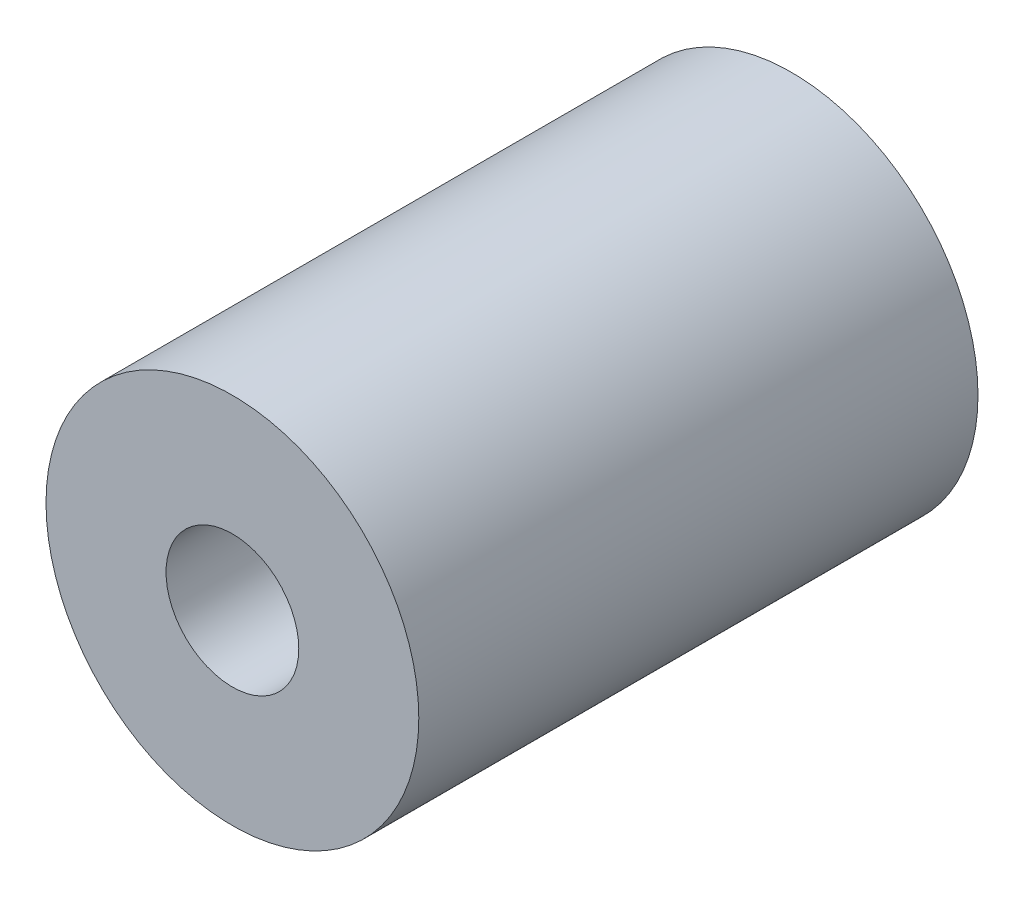
ISO-10303-21;
HEADER;
FILE_DESCRIPTION(('STEP AP214'),'2;1');
FILE_NAME('part.step','',(''),(''),'','','');
FILE_SCHEMA(('AUTOMOTIVE_DESIGN { 1 0 10303 214 1 1 1 1 }'));
ENDSEC;
DATA;
#1=APPLICATION_CONTEXT('core data for automotive mechanical design processes');
#2=APPLICATION_PROTOCOL_DEFINITION('international standard','automotive_design',2000,#1);
#3=PRODUCT_CONTEXT('',#1,'mechanical');
#4=PRODUCT('Part','Part','',(#3));
#5=PRODUCT_RELATED_PRODUCT_CATEGORY('part','',(#4));
#6=PRODUCT_DEFINITION_FORMATION('','',#4);
#7=PRODUCT_DEFINITION_CONTEXT('part definition',#1,'design');
#8=PRODUCT_DEFINITION('design','',#6,#7);
#9=PRODUCT_DEFINITION_SHAPE('','',#8);
#10=(LENGTH_UNIT() NAMED_UNIT(*) SI_UNIT(.MILLI.,.METRE.));
#11=(NAMED_UNIT(*) PLANE_ANGLE_UNIT() SI_UNIT($,.RADIAN.));
#12=(NAMED_UNIT(*) SI_UNIT($,.STERADIAN.) SOLID_ANGLE_UNIT());
#13=UNCERTAINTY_MEASURE_WITH_UNIT(LENGTH_MEASURE(1.E-05),#10,'distance_accuracy_value','');
#14=(GEOMETRIC_REPRESENTATION_CONTEXT(3) GLOBAL_UNCERTAINTY_ASSIGNED_CONTEXT((#13)) GLOBAL_UNIT_ASSIGNED_CONTEXT((#10,
#11,#12)) REPRESENTATION_CONTEXT('',''));
#15=CARTESIAN_POINT('',(0.,0.,0.));
#16=DIRECTION('',(0.,0.,1.));
#17=DIRECTION('',(1.,0.,0.));
#18=AXIS2_PLACEMENT_3D('',#15,#16,#17);
#19=CARTESIAN_POINT('',(0.,0.,-9.525));
#20=DIRECTION('',(0.,0.,1.));
#21=DIRECTION('',(1.,0.,0.));
#22=AXIS2_PLACEMENT_3D('',#19,#20,#21);
#23=CYLINDRICAL_SURFACE('',#22,3.175);
#24=CARTESIAN_POINT('',(0.,0.,-9.525));
#25=DIRECTION('',(0.,0.,1.));
#26=DIRECTION('',(1.,0.,0.));
#27=AXIS2_PLACEMENT_3D('',#24,#25,#26);
#28=CIRCLE('',#27,3.175);
#29=CARTESIAN_POINT('',(3.175,0.,-9.525));
#30=VERTEX_POINT('',#29);
#31=EDGE_CURVE('E10',#30,#30,#28,.T.);
#32=ORIENTED_EDGE('',*,*,#31,.T.);
#33=EDGE_LOOP('',(#32));
#34=FACE_BOUND('',#33,.T.);
#35=CARTESIAN_POINT('',(0.,0.,0.));
#36=DIRECTION('',(0.,0.,1.));
#37=DIRECTION('',(1.,0.,0.));
#38=AXIS2_PLACEMENT_3D('',#35,#36,#37);
#39=CIRCLE('',#38,3.175);
#40=CARTESIAN_POINT('',(3.175,0.,0.));
#41=VERTEX_POINT('',#40);
#42=EDGE_CURVE('E35',#41,#41,#39,.T.);
#43=ORIENTED_EDGE('',*,*,#42,.F.);
#44=EDGE_LOOP('',(#43));
#45=FACE_BOUND('',#44,.T.);
#46=ADVANCED_FACE('F29',(#34,#45),#23,.T.);
#47=CARTESIAN_POINT('',(0.,0.,-9.525));
#48=DIRECTION('',(0.,0.,1.));
#49=DIRECTION('',(1.,0.,0.));
#50=AXIS2_PLACEMENT_3D('',#47,#48,#49);
#51=PLANE('',#50);
#52=CARTESIAN_POINT('',(0.,0.,-9.525));
#53=DIRECTION('',(0.,0.,1.));
#54=DIRECTION('',(1.,0.,0.));
#55=AXIS2_PLACEMENT_3D('',#52,#53,#54);
#56=CIRCLE('',#55,1.1303);
#57=CARTESIAN_POINT('',(1.1303,0.,-9.525));
#58=VERTEX_POINT('',#57);
#59=EDGE_CURVE('E39',#58,#58,#56,.T.);
#60=ORIENTED_EDGE('',*,*,#59,.T.);
#61=EDGE_LOOP('',(#60));
#62=FACE_BOUND('',#61,.T.);
#63=ORIENTED_EDGE('',*,*,#31,.F.);
#64=EDGE_LOOP('',(#63));
#65=FACE_BOUND('',#64,.T.);
#66=ADVANCED_FACE('F53',(#62,#65),#51,.F.);
#67=CARTESIAN_POINT('',(0.,0.,0.));
#68=DIRECTION('',(0.,0.,1.));
#69=DIRECTION('',(1.,0.,0.));
#70=AXIS2_PLACEMENT_3D('',#67,#68,#69);
#71=PLANE('',#70);
#72=CARTESIAN_POINT('',(0.,0.,0.));
#73=DIRECTION('',(0.,0.,1.));
#74=DIRECTION('',(1.,0.,0.));
#75=AXIS2_PLACEMENT_3D('',#72,#73,#74);
#76=CIRCLE('',#75,1.1303);
#77=CARTESIAN_POINT('',(1.1303,0.,0.));
#78=VERTEX_POINT('',#77);
#79=EDGE_CURVE('E43',#78,#78,#76,.T.);
#80=ORIENTED_EDGE('',*,*,#79,.F.);
#81=EDGE_LOOP('',(#80));
#82=FACE_BOUND('',#81,.T.);
#83=ORIENTED_EDGE('',*,*,#42,.T.);
#84=EDGE_LOOP('',(#83));
#85=FACE_BOUND('',#84,.T.);
#86=ADVANCED_FACE('F51',(#82,#85),#71,.T.);
#87=CARTESIAN_POINT('',(0.,0.,-9.525));
#88=DIRECTION('',(0.,0.,1.));
#89=DIRECTION('',(1.,0.,0.));
#90=AXIS2_PLACEMENT_3D('',#87,#88,#89);
#91=CYLINDRICAL_SURFACE('',#90,1.1303);
#92=ORIENTED_EDGE('',*,*,#59,.F.);
#93=EDGE_LOOP('',(#92));
#94=FACE_BOUND('',#93,.T.);
#95=ORIENTED_EDGE('',*,*,#79,.T.);
#96=EDGE_LOOP('',(#95));
#97=FACE_BOUND('',#96,.T.);
#98=ADVANCED_FACE('F49',(#94,#97),#91,.F.);
#99=CLOSED_SHELL('',(#46,#66,#86,#98));
#100=MANIFOLD_SOLID_BREP('B2',#99);
#101=ADVANCED_BREP_SHAPE_REPRESENTATION('',(#18,#100),#14);
#102=SHAPE_DEFINITION_REPRESENTATION(#9,#101);
ENDSEC;
END-ISO-10303-21;
